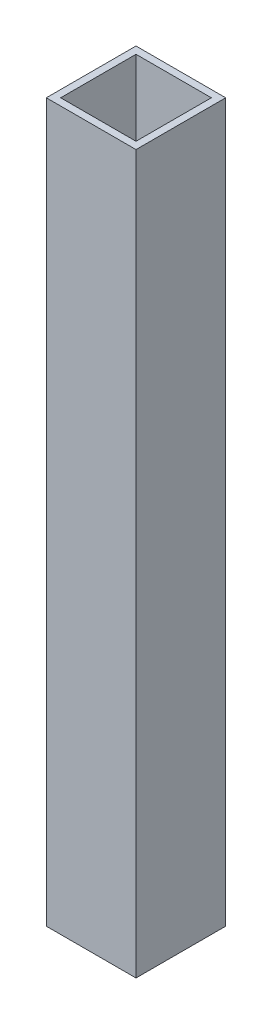
ISO-10303-21;
HEADER;
FILE_DESCRIPTION(('STEP AP214'),'2;1');
FILE_NAME('part.step','',(''),(''),'','','');
FILE_SCHEMA(('AUTOMOTIVE_DESIGN { 1 0 10303 214 1 1 1 1 }'));
ENDSEC;
DATA;
#1=APPLICATION_CONTEXT('core data for automotive mechanical design processes');
#2=APPLICATION_PROTOCOL_DEFINITION('international standard','automotive_design',2000,#1);
#3=PRODUCT_CONTEXT('',#1,'mechanical');
#4=PRODUCT('Part','Part','',(#3));
#5=PRODUCT_RELATED_PRODUCT_CATEGORY('part','',(#4));
#6=PRODUCT_DEFINITION_FORMATION('','',#4);
#7=PRODUCT_DEFINITION_CONTEXT('part definition',#1,'design');
#8=PRODUCT_DEFINITION('design','',#6,#7);
#9=PRODUCT_DEFINITION_SHAPE('','',#8);
#10=(LENGTH_UNIT() NAMED_UNIT(*) SI_UNIT(.MILLI.,.METRE.));
#11=(NAMED_UNIT(*) PLANE_ANGLE_UNIT() SI_UNIT($,.RADIAN.));
#12=(NAMED_UNIT(*) SI_UNIT($,.STERADIAN.) SOLID_ANGLE_UNIT());
#13=UNCERTAINTY_MEASURE_WITH_UNIT(LENGTH_MEASURE(1.E-05),#10,'distance_accuracy_value','');
#14=(GEOMETRIC_REPRESENTATION_CONTEXT(3) GLOBAL_UNCERTAINTY_ASSIGNED_CONTEXT((#13)) GLOBAL_UNIT_ASSIGNED_CONTEXT((#10,
#11,#12)) REPRESENTATION_CONTEXT('',''));
#15=CARTESIAN_POINT('',(0.,0.,0.));
#16=DIRECTION('',(0.,0.,1.));
#17=DIRECTION('',(1.,0.,0.));
#18=AXIS2_PLACEMENT_3D('',#15,#16,#17);
#19=CARTESIAN_POINT('',(0.,200.,0.));
#20=DIRECTION('',(0.,1.,0.));
#21=DIRECTION('',(0.,0.,1.));
#22=AXIS2_PLACEMENT_3D('',#19,#20,#21);
#23=PLANE('',#22);
#24=DIRECTION('',(0.,0.,1.));
#25=VECTOR('',#24,1.);
#26=CARTESIAN_POINT('',(-12.5,200.,-12.5));
#27=LINE('',#26,#25);
#28=CARTESIAN_POINT('',(-12.5,200.,-12.5));
#29=VERTEX_POINT('',#28);
#30=CARTESIAN_POINT('',(-12.5,200.,12.5));
#31=VERTEX_POINT('',#30);
#32=EDGE_CURVE('E135',#29,#31,#27,.T.);
#33=ORIENTED_EDGE('',*,*,#32,.T.);
#34=DIRECTION('',(1.,0.,0.));
#35=VECTOR('',#34,1.);
#36=CARTESIAN_POINT('',(-12.5,200.,12.5));
#37=LINE('',#36,#35);
#38=CARTESIAN_POINT('',(12.5,200.,12.5));
#39=VERTEX_POINT('',#38);
#40=EDGE_CURVE('E138',#31,#39,#37,.T.);
#41=ORIENTED_EDGE('',*,*,#40,.T.);
#42=DIRECTION('',(0.,0.,-1.));
#43=VECTOR('',#42,1.);
#44=CARTESIAN_POINT('',(12.5,200.,-12.5));
#45=LINE('',#44,#43);
#46=CARTESIAN_POINT('',(12.5,200.,-12.5));
#47=VERTEX_POINT('',#46);
#48=EDGE_CURVE('E141',#39,#47,#45,.T.);
#49=ORIENTED_EDGE('',*,*,#48,.T.);
#50=DIRECTION('',(-1.,0.,0.));
#51=VECTOR('',#50,1.);
#52=CARTESIAN_POINT('',(-12.5,200.,-12.5));
#53=LINE('',#52,#51);
#54=EDGE_CURVE('E143',#47,#29,#53,.T.);
#55=ORIENTED_EDGE('',*,*,#54,.T.);
#56=EDGE_LOOP('',(#33,#41,#49,#55));
#57=FACE_BOUND('',#56,.T.);
#58=DIRECTION('',(0.,0.,1.));
#59=VECTOR('',#58,1.);
#60=CARTESIAN_POINT('',(-10.5,200.,-10.5));
#61=LINE('',#60,#59);
#62=CARTESIAN_POINT('',(-10.5,200.,-10.5));
#63=VERTEX_POINT('',#62);
#64=CARTESIAN_POINT('',(-10.5,200.,10.5));
#65=VERTEX_POINT('',#64);
#66=EDGE_CURVE('E107',#63,#65,#61,.T.);
#67=ORIENTED_EDGE('',*,*,#66,.F.);
#68=DIRECTION('',(-1.,0.,0.));
#69=VECTOR('',#68,1.);
#70=CARTESIAN_POINT('',(-10.5,200.,-10.5));
#71=LINE('',#70,#69);
#72=CARTESIAN_POINT('',(10.5,200.,-10.5));
#73=VERTEX_POINT('',#72);
#74=EDGE_CURVE('E99',#73,#63,#71,.T.);
#75=ORIENTED_EDGE('',*,*,#74,.F.);
#76=DIRECTION('',(0.,0.,-1.));
#77=VECTOR('',#76,1.);
#78=CARTESIAN_POINT('',(10.5,200.,-10.5));
#79=LINE('',#78,#77);
#80=CARTESIAN_POINT('',(10.5,200.,10.5));
#81=VERTEX_POINT('',#80);
#82=EDGE_CURVE('E121',#81,#73,#79,.T.);
#83=ORIENTED_EDGE('',*,*,#82,.F.);
#84=DIRECTION('',(1.,0.,0.));
#85=VECTOR('',#84,1.);
#86=CARTESIAN_POINT('',(-10.5,200.,10.5));
#87=LINE('',#86,#85);
#88=EDGE_CURVE('E119',#65,#81,#87,.T.);
#89=ORIENTED_EDGE('',*,*,#88,.F.);
#90=EDGE_LOOP('',(#67,#75,#83,#89));
#91=FACE_BOUND('',#90,.T.);
#92=ADVANCED_FACE('F34',(#57,#91),#23,.T.);
#93=CARTESIAN_POINT('',(0.,0.,0.));
#94=DIRECTION('',(0.,1.,0.));
#95=DIRECTION('',(0.,0.,1.));
#96=AXIS2_PLACEMENT_3D('',#93,#94,#95);
#97=PLANE('',#96);
#98=DIRECTION('',(0.,0.,1.));
#99=VECTOR('',#98,1.);
#100=CARTESIAN_POINT('',(-12.5,0.,-12.5));
#101=LINE('',#100,#99);
#102=CARTESIAN_POINT('',(-12.5,0.,-12.5));
#103=VERTEX_POINT('',#102);
#104=CARTESIAN_POINT('',(-12.5,0.,12.5));
#105=VERTEX_POINT('',#104);
#106=EDGE_CURVE('E115',#103,#105,#101,.T.);
#107=ORIENTED_EDGE('',*,*,#106,.F.);
#108=DIRECTION('',(-1.,0.,0.));
#109=VECTOR('',#108,1.);
#110=CARTESIAN_POINT('',(-12.5,0.,-12.5));
#111=LINE('',#110,#109);
#112=CARTESIAN_POINT('',(12.5,0.,-12.5));
#113=VERTEX_POINT('',#112);
#114=EDGE_CURVE('E139',#113,#103,#111,.T.);
#115=ORIENTED_EDGE('',*,*,#114,.F.);
#116=DIRECTION('',(0.,0.,-1.));
#117=VECTOR('',#116,1.);
#118=CARTESIAN_POINT('',(12.5,0.,-12.5));
#119=LINE('',#118,#117);
#120=CARTESIAN_POINT('',(12.5,0.,12.5));
#121=VERTEX_POINT('',#120);
#122=EDGE_CURVE('E150',#121,#113,#119,.T.);
#123=ORIENTED_EDGE('',*,*,#122,.F.);
#124=DIRECTION('',(1.,0.,0.));
#125=VECTOR('',#124,1.);
#126=CARTESIAN_POINT('',(-12.5,0.,12.5));
#127=LINE('',#126,#125);
#128=EDGE_CURVE('E148',#105,#121,#127,.T.);
#129=ORIENTED_EDGE('',*,*,#128,.F.);
#130=EDGE_LOOP('',(#107,#115,#123,#129));
#131=FACE_BOUND('',#130,.T.);
#132=DIRECTION('',(-1.,0.,0.));
#133=VECTOR('',#132,1.);
#134=CARTESIAN_POINT('',(-10.5,0.,-10.5));
#135=LINE('',#134,#133);
#136=CARTESIAN_POINT('',(10.5,0.,-10.5));
#137=VERTEX_POINT('',#136);
#138=CARTESIAN_POINT('',(-10.5,0.,-10.5));
#139=VERTEX_POINT('',#138);
#140=EDGE_CURVE('E57',#137,#139,#135,.T.);
#141=ORIENTED_EDGE('',*,*,#140,.T.);
#142=DIRECTION('',(0.,0.,1.));
#143=VECTOR('',#142,1.);
#144=CARTESIAN_POINT('',(-10.5,0.,-10.5));
#145=LINE('',#144,#143);
#146=CARTESIAN_POINT('',(-10.5,0.,10.5));
#147=VERTEX_POINT('',#146);
#148=EDGE_CURVE('E114',#139,#147,#145,.T.);
#149=ORIENTED_EDGE('',*,*,#148,.T.);
#150=DIRECTION('',(1.,0.,0.));
#151=VECTOR('',#150,1.);
#152=CARTESIAN_POINT('',(-10.5,0.,10.5));
#153=LINE('',#152,#151);
#154=CARTESIAN_POINT('',(10.5,0.,10.5));
#155=VERTEX_POINT('',#154);
#156=EDGE_CURVE('E127',#147,#155,#153,.T.);
#157=ORIENTED_EDGE('',*,*,#156,.T.);
#158=DIRECTION('',(0.,0.,-1.));
#159=VECTOR('',#158,1.);
#160=CARTESIAN_POINT('',(10.5,0.,-10.5));
#161=LINE('',#160,#159);
#162=EDGE_CURVE('E108',#155,#137,#161,.T.);
#163=ORIENTED_EDGE('',*,*,#162,.T.);
#164=EDGE_LOOP('',(#141,#149,#157,#163));
#165=FACE_BOUND('',#164,.T.);
#166=ADVANCED_FACE('F168',(#131,#165),#97,.F.);
#167=CARTESIAN_POINT('',(-12.5,200.,-12.5));
#168=DIRECTION('',(1.,0.,0.));
#169=DIRECTION('',(0.,0.,-1.));
#170=AXIS2_PLACEMENT_3D('',#167,#168,#169);
#171=PLANE('',#170);
#172=ORIENTED_EDGE('',*,*,#106,.T.);
#173=DIRECTION('',(0.,-1.,0.));
#174=VECTOR('',#173,1.);
#175=CARTESIAN_POINT('',(-12.5,200.,12.5));
#176=LINE('',#175,#174);
#177=EDGE_CURVE('E11',#31,#105,#176,.T.);
#178=ORIENTED_EDGE('',*,*,#177,.F.);
#179=ORIENTED_EDGE('',*,*,#32,.F.);
#180=DIRECTION('',(0.,-1.,0.));
#181=VECTOR('',#180,1.);
#182=CARTESIAN_POINT('',(-12.5,200.,-12.5));
#183=LINE('',#182,#181);
#184=EDGE_CURVE('E145',#29,#103,#183,.T.);
#185=ORIENTED_EDGE('',*,*,#184,.T.);
#186=EDGE_LOOP('',(#172,#178,#179,#185));
#187=FACE_BOUND('',#186,.T.);
#188=ADVANCED_FACE('F36',(#187),#171,.F.);
#189=CARTESIAN_POINT('',(-12.5,200.,12.5));
#190=DIRECTION('',(0.,0.,-1.));
#191=DIRECTION('',(-1.,0.,0.));
#192=AXIS2_PLACEMENT_3D('',#189,#190,#191);
#193=PLANE('',#192);
#194=ORIENTED_EDGE('',*,*,#128,.T.);
#195=DIRECTION('',(0.,-1.,0.));
#196=VECTOR('',#195,1.);
#197=CARTESIAN_POINT('',(12.5,200.,12.5));
#198=LINE('',#197,#196);
#199=EDGE_CURVE('E42',#39,#121,#198,.T.);
#200=ORIENTED_EDGE('',*,*,#199,.F.);
#201=ORIENTED_EDGE('',*,*,#40,.F.);
#202=ORIENTED_EDGE('',*,*,#177,.T.);
#203=EDGE_LOOP('',(#194,#200,#201,#202));
#204=FACE_BOUND('',#203,.T.);
#205=ADVANCED_FACE('F178',(#204),#193,.F.);
#206=CARTESIAN_POINT('',(12.5,200.,-12.5));
#207=DIRECTION('',(-1.,0.,0.));
#208=DIRECTION('',(0.,0.,1.));
#209=AXIS2_PLACEMENT_3D('',#206,#207,#208);
#210=PLANE('',#209);
#211=ORIENTED_EDGE('',*,*,#122,.T.);
#212=DIRECTION('',(0.,-1.,0.));
#213=VECTOR('',#212,1.);
#214=CARTESIAN_POINT('',(12.5,200.,-12.5));
#215=LINE('',#214,#213);
#216=EDGE_CURVE('E155',#47,#113,#215,.T.);
#217=ORIENTED_EDGE('',*,*,#216,.F.);
#218=ORIENTED_EDGE('',*,*,#48,.F.);
#219=ORIENTED_EDGE('',*,*,#199,.T.);
#220=EDGE_LOOP('',(#211,#217,#218,#219));
#221=FACE_BOUND('',#220,.T.);
#222=ADVANCED_FACE('F162',(#221),#210,.F.);
#223=CARTESIAN_POINT('',(-12.5,200.,-12.5));
#224=DIRECTION('',(0.,0.,1.));
#225=DIRECTION('',(1.,0.,0.));
#226=AXIS2_PLACEMENT_3D('',#223,#224,#225);
#227=PLANE('',#226);
#228=ORIENTED_EDGE('',*,*,#114,.T.);
#229=ORIENTED_EDGE('',*,*,#184,.F.);
#230=ORIENTED_EDGE('',*,*,#54,.F.);
#231=ORIENTED_EDGE('',*,*,#216,.T.);
#232=EDGE_LOOP('',(#228,#229,#230,#231));
#233=FACE_BOUND('',#232,.T.);
#234=ADVANCED_FACE('F172',(#233),#227,.F.);
#235=CARTESIAN_POINT('',(-10.5,200.,-10.5));
#236=DIRECTION('',(0.,0.,1.));
#237=DIRECTION('',(1.,0.,0.));
#238=AXIS2_PLACEMENT_3D('',#235,#236,#237);
#239=PLANE('',#238);
#240=ORIENTED_EDGE('',*,*,#140,.F.);
#241=DIRECTION('',(0.,-1.,0.));
#242=VECTOR('',#241,1.);
#243=CARTESIAN_POINT('',(10.5,200.,-10.5));
#244=LINE('',#243,#242);
#245=EDGE_CURVE('E103',#73,#137,#244,.T.);
#246=ORIENTED_EDGE('',*,*,#245,.F.);
#247=ORIENTED_EDGE('',*,*,#74,.T.);
#248=DIRECTION('',(0.,-1.,0.));
#249=VECTOR('',#248,1.);
#250=CARTESIAN_POINT('',(-10.5,200.,-10.5));
#251=LINE('',#250,#249);
#252=EDGE_CURVE('E102',#63,#139,#251,.T.);
#253=ORIENTED_EDGE('',*,*,#252,.T.);
#254=EDGE_LOOP('',(#240,#246,#247,#253));
#255=FACE_BOUND('',#254,.T.);
#256=ADVANCED_FACE('F101',(#255),#239,.T.);
#257=CARTESIAN_POINT('',(-10.5,200.,-10.5));
#258=DIRECTION('',(1.,0.,0.));
#259=DIRECTION('',(0.,0.,-1.));
#260=AXIS2_PLACEMENT_3D('',#257,#258,#259);
#261=PLANE('',#260);
#262=ORIENTED_EDGE('',*,*,#148,.F.);
#263=ORIENTED_EDGE('',*,*,#252,.F.);
#264=ORIENTED_EDGE('',*,*,#66,.T.);
#265=DIRECTION('',(0.,-1.,0.));
#266=VECTOR('',#265,1.);
#267=CARTESIAN_POINT('',(-10.5,200.,10.5));
#268=LINE('',#267,#266);
#269=EDGE_CURVE('E116',#65,#147,#268,.T.);
#270=ORIENTED_EDGE('',*,*,#269,.T.);
#271=EDGE_LOOP('',(#262,#263,#264,#270));
#272=FACE_BOUND('',#271,.T.);
#273=ADVANCED_FACE('F111',(#272),#261,.T.);
#274=CARTESIAN_POINT('',(-10.5,200.,10.5));
#275=DIRECTION('',(0.,0.,-1.));
#276=DIRECTION('',(-1.,0.,0.));
#277=AXIS2_PLACEMENT_3D('',#274,#275,#276);
#278=PLANE('',#277);
#279=ORIENTED_EDGE('',*,*,#156,.F.);
#280=ORIENTED_EDGE('',*,*,#269,.F.);
#281=ORIENTED_EDGE('',*,*,#88,.T.);
#282=DIRECTION('',(0.,-1.,0.));
#283=VECTOR('',#282,1.);
#284=CARTESIAN_POINT('',(10.5,200.,10.5));
#285=LINE('',#284,#283);
#286=EDGE_CURVE('E49',#81,#155,#285,.T.);
#287=ORIENTED_EDGE('',*,*,#286,.T.);
#288=EDGE_LOOP('',(#279,#280,#281,#287));
#289=FACE_BOUND('',#288,.T.);
#290=ADVANCED_FACE('F201',(#289),#278,.T.);
#291=CARTESIAN_POINT('',(10.5,200.,-10.5));
#292=DIRECTION('',(-1.,0.,0.));
#293=DIRECTION('',(0.,0.,1.));
#294=AXIS2_PLACEMENT_3D('',#291,#292,#293);
#295=PLANE('',#294);
#296=ORIENTED_EDGE('',*,*,#162,.F.);
#297=ORIENTED_EDGE('',*,*,#286,.F.);
#298=ORIENTED_EDGE('',*,*,#82,.T.);
#299=ORIENTED_EDGE('',*,*,#245,.T.);
#300=EDGE_LOOP('',(#296,#297,#298,#299));
#301=FACE_BOUND('',#300,.T.);
#302=ADVANCED_FACE('F205',(#301),#295,.T.);
#303=CLOSED_SHELL('',(#92,#166,#188,#205,#222,#234,#256,#273,#290,#302));
#304=MANIFOLD_SOLID_BREP('B2',#303);
#305=ADVANCED_BREP_SHAPE_REPRESENTATION('',(#18,#304),#14);
#306=SHAPE_DEFINITION_REPRESENTATION(#9,#305);
ENDSEC;
END-ISO-10303-21;
